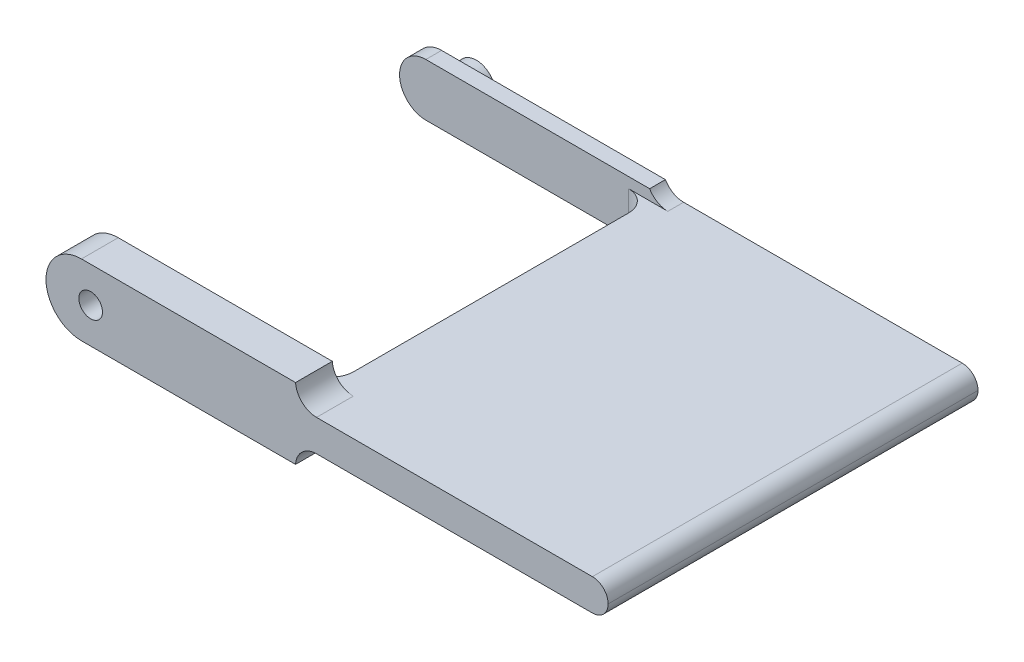
ISO-10303-21;
HEADER;
FILE_DESCRIPTION(('STEP AP214'),'2;1');
FILE_NAME('part.step','',(''),(''),'','','');
FILE_SCHEMA(('AUTOMOTIVE_DESIGN { 1 0 10303 214 1 1 1 1 }'));
ENDSEC;
DATA;
#1=APPLICATION_CONTEXT('core data for automotive mechanical design processes');
#2=APPLICATION_PROTOCOL_DEFINITION('international standard','automotive_design',2000,#1);
#3=PRODUCT_CONTEXT('',#1,'mechanical');
#4=PRODUCT('Part','Part','',(#3));
#5=PRODUCT_RELATED_PRODUCT_CATEGORY('part','',(#4));
#6=PRODUCT_DEFINITION_FORMATION('','',#4);
#7=PRODUCT_DEFINITION_CONTEXT('part definition',#1,'design');
#8=PRODUCT_DEFINITION('design','',#6,#7);
#9=PRODUCT_DEFINITION_SHAPE('','',#8);
#10=(LENGTH_UNIT() NAMED_UNIT(*) SI_UNIT(.MILLI.,.METRE.));
#11=(NAMED_UNIT(*) PLANE_ANGLE_UNIT() SI_UNIT($,.RADIAN.));
#12=(NAMED_UNIT(*) SI_UNIT($,.STERADIAN.) SOLID_ANGLE_UNIT());
#13=UNCERTAINTY_MEASURE_WITH_UNIT(LENGTH_MEASURE(1.E-05),#10,'distance_accuracy_value','');
#14=(GEOMETRIC_REPRESENTATION_CONTEXT(3) GLOBAL_UNCERTAINTY_ASSIGNED_CONTEXT((#13)) GLOBAL_UNIT_ASSIGNED_CONTEXT((#10,
#11,#12)) REPRESENTATION_CONTEXT('',''));
#15=CARTESIAN_POINT('',(0.,0.,0.));
#16=DIRECTION('',(0.,0.,1.));
#17=DIRECTION('',(1.,0.,0.));
#18=AXIS2_PLACEMENT_3D('',#15,#16,#17);
#19=CARTESIAN_POINT('',(0.,0.,0.));
#20=DIRECTION('',(0.,0.,1.));
#21=DIRECTION('',(1.,0.,0.));
#22=AXIS2_PLACEMENT_3D('',#19,#20,#21);
#23=PLANE('',#22);
#24=DIRECTION('',(1.,0.,0.));
#25=VECTOR('',#24,1.);
#26=CARTESIAN_POINT('',(0.,1.5,0.));
#27=LINE('',#26,#25);
#28=CARTESIAN_POINT('',(21.2320508075689,1.5,0.));
#29=VERTEX_POINT('',#28);
#30=CARTESIAN_POINT('',(47.75,1.5,0.));
#31=VERTEX_POINT('',#30);
#32=EDGE_CURVE('E259',#29,#31,#27,.T.);
#33=ORIENTED_EDGE('',*,*,#32,.T.);
#34=CARTESIAN_POINT('',(47.75,0.,0.));
#35=DIRECTION('',(0.,0.,1.));
#36=DIRECTION('',(1.,0.,0.));
#37=AXIS2_PLACEMENT_3D('',#34,#35,#36);
#38=CIRCLE('',#37,1.5);
#39=CARTESIAN_POINT('',(49.25,0.,0.));
#40=VERTEX_POINT('',#39);
#41=EDGE_CURVE('E69',#31,#40,#38,.F.);
#42=ORIENTED_EDGE('',*,*,#41,.T.);
#43=CARTESIAN_POINT('',(47.75,0.,0.));
#44=DIRECTION('',(0.,0.,1.));
#45=DIRECTION('',(1.,0.,0.));
#46=AXIS2_PLACEMENT_3D('',#43,#44,#45);
#47=CIRCLE('',#46,1.5);
#48=CARTESIAN_POINT('',(47.75,-1.5,0.));
#49=VERTEX_POINT('',#48);
#50=EDGE_CURVE('E76',#40,#49,#47,.F.);
#51=ORIENTED_EDGE('',*,*,#50,.T.);
#52=DIRECTION('',(1.,0.,0.));
#53=VECTOR('',#52,1.);
#54=CARTESIAN_POINT('',(0.,-1.5,0.));
#55=LINE('',#54,#53);
#56=CARTESIAN_POINT('',(21.2320508075689,-1.5,0.));
#57=VERTEX_POINT('',#56);
#58=EDGE_CURVE('E261',#57,#49,#55,.T.);
#59=ORIENTED_EDGE('',*,*,#58,.F.);
#60=CARTESIAN_POINT('',(21.2320508075689,-3.5,0.));
#61=DIRECTION('',(0.,0.,1.));
#62=DIRECTION('',(1.,0.,0.));
#63=AXIS2_PLACEMENT_3D('',#60,#61,#62);
#64=CIRCLE('',#63,2.);
#65=CARTESIAN_POINT('',(19.5,-2.5,0.));
#66=VERTEX_POINT('',#65);
#67=EDGE_CURVE('E351',#57,#66,#64,.T.);
#68=ORIENTED_EDGE('',*,*,#67,.T.);
#69=DIRECTION('',(1.,0.,0.));
#70=VECTOR('',#69,1.);
#71=CARTESIAN_POINT('',(0.,-2.5,0.));
#72=LINE('',#71,#70);
#73=CARTESIAN_POINT('',(-1.8,-2.5,0.));
#74=VERTEX_POINT('',#73);
#75=EDGE_CURVE('E237',#74,#66,#72,.T.);
#76=ORIENTED_EDGE('',*,*,#75,.F.);
#77=CARTESIAN_POINT('',(-1.8,0.,0.));
#78=DIRECTION('',(0.,0.,1.));
#79=DIRECTION('',(1.,0.,0.));
#80=AXIS2_PLACEMENT_3D('',#77,#78,#79);
#81=CIRCLE('',#80,2.5);
#82=CARTESIAN_POINT('',(-4.3,0.,0.));
#83=VERTEX_POINT('',#82);
#84=EDGE_CURVE('E406',#74,#83,#81,.F.);
#85=ORIENTED_EDGE('',*,*,#84,.T.);
#86=CARTESIAN_POINT('',(-1.8,0.,0.));
#87=DIRECTION('',(0.,0.,1.));
#88=DIRECTION('',(1.,0.,0.));
#89=AXIS2_PLACEMENT_3D('',#86,#87,#88);
#90=CIRCLE('',#89,2.5);
#91=CARTESIAN_POINT('',(-1.8,2.5,0.));
#92=VERTEX_POINT('',#91);
#93=EDGE_CURVE('E404',#83,#92,#90,.F.);
#94=ORIENTED_EDGE('',*,*,#93,.T.);
#95=DIRECTION('',(1.,0.,0.));
#96=VECTOR('',#95,1.);
#97=CARTESIAN_POINT('',(0.,2.5,0.));
#98=LINE('',#97,#96);
#99=CARTESIAN_POINT('',(19.5,2.5,0.));
#100=VERTEX_POINT('',#99);
#101=EDGE_CURVE('E348',#92,#100,#98,.T.);
#102=ORIENTED_EDGE('',*,*,#101,.T.);
#103=CARTESIAN_POINT('',(21.2320508075689,3.5,0.));
#104=DIRECTION('',(0.,0.,1.));
#105=DIRECTION('',(1.,0.,0.));
#106=AXIS2_PLACEMENT_3D('',#103,#104,#105);
#107=CIRCLE('',#106,2.);
#108=EDGE_CURVE('E247',#100,#29,#107,.T.);
#109=ORIENTED_EDGE('',*,*,#108,.T.);
#110=EDGE_LOOP('',(#33,#42,#51,#59,#68,#76,#85,#94,#102,#109));
#111=FACE_BOUND('',#110,.T.);
#112=CARTESIAN_POINT('',(0.,0.,0.));
#113=DIRECTION('',(0.,0.,1.));
#114=DIRECTION('',(1.,0.,0.));
#115=AXIS2_PLACEMENT_3D('',#112,#113,#114);
#116=CIRCLE('',#115,1.85);
#117=CARTESIAN_POINT('',(1.85,0.,0.));
#118=VERTEX_POINT('',#117);
#119=EDGE_CURVE('E333',#118,#118,#116,.F.);
#120=ORIENTED_EDGE('',*,*,#119,.F.);
#121=EDGE_LOOP('',(#120));
#122=FACE_BOUND('',#121,.T.);
#123=ADVANCED_FACE('F60',(#111,#122),#23,.F.);
#124=CARTESIAN_POINT('',(19.5,0.,-29.9008779135329));
#125=DIRECTION('',(-1.,0.,0.));
#126=DIRECTION('',(0.,0.,1.));
#127=AXIS2_PLACEMENT_3D('',#124,#125,#126);
#128=PLANE('',#127);
#129=DIRECTION('',(0.,0.,1.));
#130=VECTOR('',#129,1.);
#131=CARTESIAN_POINT('',(19.5,-1.5,-29.9008779135329));
#132=LINE('',#131,#130);
#133=CARTESIAN_POINT('',(19.5,-1.5,3.5));
#134=VERTEX_POINT('',#133);
#135=CARTESIAN_POINT('',(19.5,-1.5,29.7));
#136=VERTEX_POINT('',#135);
#137=EDGE_CURVE('E262',#134,#136,#132,.T.);
#138=ORIENTED_EDGE('',*,*,#137,.T.);
#139=DIRECTION('',(0.,1.,0.));
#140=VECTOR('',#139,1.);
#141=CARTESIAN_POINT('',(19.5,0.,29.7));
#142=LINE('',#141,#140);
#143=CARTESIAN_POINT('',(19.5,1.5,29.7));
#144=VERTEX_POINT('',#143);
#145=EDGE_CURVE('E366',#136,#144,#142,.T.);
#146=ORIENTED_EDGE('',*,*,#145,.T.);
#147=DIRECTION('',(0.,0.,1.));
#148=VECTOR('',#147,1.);
#149=CARTESIAN_POINT('',(19.5,1.5,-29.9008779135329));
#150=LINE('',#149,#148);
#151=CARTESIAN_POINT('',(19.5,1.5,3.5));
#152=VERTEX_POINT('',#151);
#153=EDGE_CURVE('E265',#152,#144,#150,.T.);
#154=ORIENTED_EDGE('',*,*,#153,.F.);
#155=DIRECTION('',(0.,-1.,0.));
#156=VECTOR('',#155,1.);
#157=CARTESIAN_POINT('',(19.5,0.,3.5));
#158=LINE('',#157,#156);
#159=EDGE_CURVE('E363',#152,#134,#158,.T.);
#160=ORIENTED_EDGE('',*,*,#159,.T.);
#161=EDGE_LOOP('',(#138,#146,#154,#160));
#162=FACE_BOUND('',#161,.T.);
#163=ADVANCED_FACE('F420',(#162),#128,.T.);
#164=CARTESIAN_POINT('',(0.,0.,33.2));
#165=DIRECTION('',(0.,0.,1.));
#166=DIRECTION('',(1.,0.,0.));
#167=AXIS2_PLACEMENT_3D('',#164,#165,#166);
#168=PLANE('',#167);
#169=CARTESIAN_POINT('',(0.,0.,33.2));
#170=DIRECTION('',(0.,0.,1.));
#171=DIRECTION('',(1.,0.,0.));
#172=AXIS2_PLACEMENT_3D('',#169,#170,#171);
#173=CIRCLE('',#172,1.125);
#174=CARTESIAN_POINT('',(1.125,0.,33.2));
#175=VERTEX_POINT('',#174);
#176=EDGE_CURVE('E300',#175,#175,#173,.T.);
#177=ORIENTED_EDGE('',*,*,#176,.T.);
#178=EDGE_LOOP('',(#177));
#179=FACE_BOUND('',#178,.T.);
#180=DIRECTION('',(-1.,0.,0.));
#181=VECTOR('',#180,1.);
#182=CARTESIAN_POINT('',(0.,1.635,33.2));
#183=LINE('',#182,#181);
#184=CARTESIAN_POINT('',(12.065,1.63500000000001,33.2));
#185=VERTEX_POINT('',#184);
#186=CARTESIAN_POINT('',(2.5153081322176,1.63500000000001,33.2));
#187=VERTEX_POINT('',#186);
#188=EDGE_CURVE('E264',#185,#187,#183,.T.);
#189=ORIENTED_EDGE('',*,*,#188,.F.);
#190=CARTESIAN_POINT('',(12.065,0.,33.2));
#191=DIRECTION('',(0.,0.,1.));
#192=DIRECTION('',(1.,0.,0.));
#193=AXIS2_PLACEMENT_3D('',#190,#191,#192);
#194=CIRCLE('',#193,1.635);
#195=CARTESIAN_POINT('',(12.065,-1.635,33.2));
#196=VERTEX_POINT('',#195);
#197=EDGE_CURVE('E290',#185,#196,#194,.F.);
#198=ORIENTED_EDGE('',*,*,#197,.T.);
#199=DIRECTION('',(-1.,0.,0.));
#200=VECTOR('',#199,1.);
#201=CARTESIAN_POINT('',(0.,-1.635,33.2));
#202=LINE('',#201,#200);
#203=CARTESIAN_POINT('',(2.5153081322176,-1.635,33.2));
#204=VERTEX_POINT('',#203);
#205=EDGE_CURVE('E293',#196,#204,#202,.T.);
#206=ORIENTED_EDGE('',*,*,#205,.T.);
#207=CARTESIAN_POINT('',(0.,0.,33.2));
#208=DIRECTION('',(0.,0.,1.));
#209=DIRECTION('',(1.,0.,0.));
#210=AXIS2_PLACEMENT_3D('',#207,#208,#209);
#211=CIRCLE('',#210,3.);
#212=EDGE_CURVE('E274',#187,#204,#211,.T.);
#213=ORIENTED_EDGE('',*,*,#212,.F.);
#214=EDGE_LOOP('',(#189,#198,#206,#213));
#215=FACE_BOUND('',#214,.T.);
#216=ADVANCED_FACE('F425',(#179,#215),#168,.F.);
#217=CARTESIAN_POINT('',(0.,-3.375,35.2));
#218=DIRECTION('',(0.,1.,0.));
#219=DIRECTION('',(0.,0.,1.));
#220=AXIS2_PLACEMENT_3D('',#217,#218,#219);
#221=PLANE('',#220);
#222=DIRECTION('',(1.,0.,0.));
#223=VECTOR('',#222,1.);
#224=CARTESIAN_POINT('',(0.,-3.375,35.2));
#225=LINE('',#224,#223);
#226=CARTESIAN_POINT('',(-0.875,-3.375,35.2));
#227=VERTEX_POINT('',#226);
#228=CARTESIAN_POINT('',(19.5,-3.375,35.2));
#229=VERTEX_POINT('',#228);
#230=EDGE_CURVE('E310',#227,#229,#225,.T.);
#231=ORIENTED_EDGE('',*,*,#230,.F.);
#232=DIRECTION('',(0.,0.,-1.));
#233=VECTOR('',#232,1.);
#234=CARTESIAN_POINT('',(-0.875,-3.375,31.7));
#235=LINE('',#234,#233);
#236=CARTESIAN_POINT('',(-0.875,-3.375,31.7));
#237=VERTEX_POINT('',#236);
#238=EDGE_CURVE('E395',#227,#237,#235,.T.);
#239=ORIENTED_EDGE('',*,*,#238,.T.);
#240=DIRECTION('',(1.,0.,0.));
#241=VECTOR('',#240,1.);
#242=CARTESIAN_POINT('',(0.,-3.375,31.7));
#243=LINE('',#242,#241);
#244=CARTESIAN_POINT('',(19.5,-3.375,31.7));
#245=VERTEX_POINT('',#244);
#246=EDGE_CURVE('E271',#237,#245,#243,.T.);
#247=ORIENTED_EDGE('',*,*,#246,.T.);
#248=DIRECTION('',(0.,0.,-1.));
#249=VECTOR('',#248,1.);
#250=CARTESIAN_POINT('',(19.5,-3.375,35.2));
#251=LINE('',#250,#249);
#252=EDGE_CURVE('E319',#229,#245,#251,.T.);
#253=ORIENTED_EDGE('',*,*,#252,.F.);
#254=EDGE_LOOP('',(#231,#239,#247,#253));
#255=FACE_BOUND('',#254,.T.);
#256=ADVANCED_FACE('F465',(#255),#221,.F.);
#257=CARTESIAN_POINT('',(0.,3.375,35.2));
#258=DIRECTION('',(0.,1.,0.));
#259=DIRECTION('',(0.,0.,1.));
#260=AXIS2_PLACEMENT_3D('',#257,#258,#259);
#261=PLANE('',#260);
#262=DIRECTION('',(1.,0.,0.));
#263=VECTOR('',#262,1.);
#264=CARTESIAN_POINT('',(0.,3.375,31.7));
#265=LINE('',#264,#263);
#266=CARTESIAN_POINT('',(-0.875,3.375,31.7));
#267=VERTEX_POINT('',#266);
#268=CARTESIAN_POINT('',(19.5,3.375,31.7));
#269=VERTEX_POINT('',#268);
#270=EDGE_CURVE('E273',#267,#269,#265,.T.);
#271=ORIENTED_EDGE('',*,*,#270,.F.);
#272=DIRECTION('',(0.,0.,-1.));
#273=VECTOR('',#272,1.);
#274=CARTESIAN_POINT('',(-0.875,3.375,35.2));
#275=LINE('',#274,#273);
#276=CARTESIAN_POINT('',(-0.875,3.375,35.2));
#277=VERTEX_POINT('',#276);
#278=EDGE_CURVE('E388',#267,#277,#275,.F.);
#279=ORIENTED_EDGE('',*,*,#278,.T.);
#280=DIRECTION('',(1.,0.,0.));
#281=VECTOR('',#280,1.);
#282=CARTESIAN_POINT('',(0.,3.375,35.2));
#283=LINE('',#282,#281);
#284=CARTESIAN_POINT('',(19.5,3.375,35.2));
#285=VERTEX_POINT('',#284);
#286=EDGE_CURVE('E312',#277,#285,#283,.T.);
#287=ORIENTED_EDGE('',*,*,#286,.T.);
#288=DIRECTION('',(0.,0.,-1.));
#289=VECTOR('',#288,1.);
#290=CARTESIAN_POINT('',(19.5,3.375,35.2));
#291=LINE('',#290,#289);
#292=EDGE_CURVE('E314',#285,#269,#291,.T.);
#293=ORIENTED_EDGE('',*,*,#292,.T.);
#294=EDGE_LOOP('',(#271,#279,#287,#293));
#295=FACE_BOUND('',#294,.T.);
#296=ADVANCED_FACE('F467',(#295),#261,.T.);
#297=CARTESIAN_POINT('',(0.,0.,35.2));
#298=DIRECTION('',(0.,0.,-1.));
#299=DIRECTION('',(-1.,0.,0.));
#300=AXIS2_PLACEMENT_3D('',#297,#298,#299);
#301=CYLINDRICAL_SURFACE('',#300,1.125);
#302=CARTESIAN_POINT('',(0.,0.,35.2));
#303=DIRECTION('',(0.,0.,1.));
#304=DIRECTION('',(1.,0.,0.));
#305=AXIS2_PLACEMENT_3D('',#302,#303,#304);
#306=CIRCLE('',#305,1.125);
#307=CARTESIAN_POINT('',(1.125,0.,35.2));
#308=VERTEX_POINT('',#307);
#309=EDGE_CURVE('E307',#308,#308,#306,.T.);
#310=ORIENTED_EDGE('',*,*,#309,.T.);
#311=EDGE_LOOP('',(#310));
#312=FACE_BOUND('',#311,.T.);
#313=ORIENTED_EDGE('',*,*,#176,.F.);
#314=EDGE_LOOP('',(#313));
#315=FACE_BOUND('',#314,.T.);
#316=ADVANCED_FACE('F461',(#312,#315),#301,.F.);
#317=CARTESIAN_POINT('',(0.,0.,35.2));
#318=DIRECTION('',(0.,0.,1.));
#319=DIRECTION('',(1.,0.,0.));
#320=AXIS2_PLACEMENT_3D('',#317,#318,#319);
#321=PLANE('',#320);
#322=ORIENTED_EDGE('',*,*,#309,.F.);
#323=EDGE_LOOP('',(#322));
#324=FACE_BOUND('',#323,.T.);
#325=CARTESIAN_POINT('',(47.75,0.,35.2));
#326=DIRECTION('',(0.,0.,1.));
#327=DIRECTION('',(1.,0.,0.));
#328=AXIS2_PLACEMENT_3D('',#325,#326,#327);
#329=CIRCLE('',#328,1.5);
#330=CARTESIAN_POINT('',(47.75,-1.5,35.2));
#331=VERTEX_POINT('',#330);
#332=CARTESIAN_POINT('',(49.25,0.,35.2));
#333=VERTEX_POINT('',#332);
#334=EDGE_CURVE('E330',#331,#333,#329,.T.);
#335=ORIENTED_EDGE('',*,*,#334,.T.);
#336=CARTESIAN_POINT('',(47.75,0.,35.2));
#337=DIRECTION('',(0.,0.,1.));
#338=DIRECTION('',(1.,0.,0.));
#339=AXIS2_PLACEMENT_3D('',#336,#337,#338);
#340=CIRCLE('',#339,1.5);
#341=CARTESIAN_POINT('',(47.75,1.5,35.2));
#342=VERTEX_POINT('',#341);
#343=EDGE_CURVE('E332',#333,#342,#340,.T.);
#344=ORIENTED_EDGE('',*,*,#343,.T.);
#345=DIRECTION('',(-1.,0.,0.));
#346=VECTOR('',#345,1.);
#347=CARTESIAN_POINT('',(0.,1.5,35.2));
#348=LINE('',#347,#346);
#349=CARTESIAN_POINT('',(21.4960899278339,1.5,35.2));
#350=VERTEX_POINT('',#349);
#351=EDGE_CURVE('E268',#342,#350,#348,.T.);
#352=ORIENTED_EDGE('',*,*,#351,.T.);
#353=CARTESIAN_POINT('',(21.4960899278339,3.5,35.2));
#354=DIRECTION('',(0.,0.,1.));
#355=DIRECTION('',(1.,0.,0.));
#356=AXIS2_PLACEMENT_3D('',#353,#354,#355);
#357=CIRCLE('',#356,2.);
#358=EDGE_CURVE('E542',#350,#285,#357,.F.);
#359=ORIENTED_EDGE('',*,*,#358,.T.);
#360=ORIENTED_EDGE('',*,*,#286,.F.);
#361=CARTESIAN_POINT('',(-0.875,0.,35.2));
#362=DIRECTION('',(0.,0.,1.));
#363=DIRECTION('',(1.,0.,0.));
#364=AXIS2_PLACEMENT_3D('',#361,#362,#363);
#365=CIRCLE('',#364,3.375);
#366=CARTESIAN_POINT('',(-4.25,0.,35.2));
#367=VERTEX_POINT('',#366);
#368=EDGE_CURVE('E393',#277,#367,#365,.T.);
#369=ORIENTED_EDGE('',*,*,#368,.T.);
#370=CARTESIAN_POINT('',(-0.875,0.,35.2));
#371=DIRECTION('',(0.,0.,1.));
#372=DIRECTION('',(1.,0.,0.));
#373=AXIS2_PLACEMENT_3D('',#370,#371,#372);
#374=CIRCLE('',#373,3.375);
#375=EDGE_CURVE('E391',#367,#227,#374,.T.);
#376=ORIENTED_EDGE('',*,*,#375,.T.);
#377=ORIENTED_EDGE('',*,*,#230,.T.);
#378=CARTESIAN_POINT('',(21.4960899278339,-3.5,35.2));
#379=DIRECTION('',(0.,0.,1.));
#380=DIRECTION('',(1.,0.,0.));
#381=AXIS2_PLACEMENT_3D('',#378,#379,#380);
#382=CIRCLE('',#381,2.);
#383=CARTESIAN_POINT('',(21.4960899278339,-1.5,35.2));
#384=VERTEX_POINT('',#383);
#385=EDGE_CURVE('E357',#229,#384,#382,.F.);
#386=ORIENTED_EDGE('',*,*,#385,.T.);
#387=DIRECTION('',(-1.,0.,0.));
#388=VECTOR('',#387,1.);
#389=CARTESIAN_POINT('',(0.,-1.5,35.2));
#390=LINE('',#389,#388);
#391=EDGE_CURVE('E254',#331,#384,#390,.T.);
#392=ORIENTED_EDGE('',*,*,#391,.F.);
#393=EDGE_LOOP('',(#335,#344,#352,#359,#360,#369,#376,#377,#386,#392));
#394=FACE_BOUND('',#393,.T.);
#395=ADVANCED_FACE('F457',(#324,#394),#321,.T.);
#396=CARTESIAN_POINT('',(0.,1.635,31.7));
#397=DIRECTION('',(0.,1.,0.));
#398=DIRECTION('',(-1.,0.,0.));
#399=AXIS2_PLACEMENT_3D('',#396,#397,#398);
#400=PLANE('',#399);
#401=ORIENTED_EDGE('',*,*,#188,.T.);
#402=DIRECTION('',(0.,0.,1.));
#403=VECTOR('',#402,1.);
#404=CARTESIAN_POINT('',(2.5153081322176,1.63500000000001,31.7));
#405=LINE('',#404,#403);
#406=CARTESIAN_POINT('',(2.5153081322176,1.63500000000001,31.7));
#407=VERTEX_POINT('',#406);
#408=EDGE_CURVE('E298',#407,#187,#405,.T.);
#409=ORIENTED_EDGE('',*,*,#408,.F.);
#410=DIRECTION('',(-1.,0.,0.));
#411=VECTOR('',#410,1.);
#412=CARTESIAN_POINT('',(0.,1.635,31.7));
#413=LINE('',#412,#411);
#414=CARTESIAN_POINT('',(12.065,1.63500000000001,31.7));
#415=VERTEX_POINT('',#414);
#416=EDGE_CURVE('E276',#415,#407,#413,.T.);
#417=ORIENTED_EDGE('',*,*,#416,.F.);
#418=DIRECTION('',(0.,0.,1.));
#419=VECTOR('',#418,1.);
#420=CARTESIAN_POINT('',(12.065,1.63500000000001,31.7));
#421=LINE('',#420,#419);
#422=EDGE_CURVE('E287',#415,#185,#421,.T.);
#423=ORIENTED_EDGE('',*,*,#422,.T.);
#424=EDGE_LOOP('',(#401,#409,#417,#423));
#425=FACE_BOUND('',#424,.T.);
#426=ADVANCED_FACE('F447',(#425),#400,.F.);
#427=CARTESIAN_POINT('',(0.,0.,31.7));
#428=DIRECTION('',(0.,0.,1.));
#429=DIRECTION('',(1.,0.,0.));
#430=AXIS2_PLACEMENT_3D('',#427,#428,#429);
#431=CYLINDRICAL_SURFACE('',#430,3.);
#432=ORIENTED_EDGE('',*,*,#212,.T.);
#433=DIRECTION('',(0.,0.,1.));
#434=VECTOR('',#433,1.);
#435=CARTESIAN_POINT('',(2.5153081322176,-1.635,31.7));
#436=LINE('',#435,#434);
#437=CARTESIAN_POINT('',(2.5153081322176,-1.635,31.7));
#438=VERTEX_POINT('',#437);
#439=EDGE_CURVE('E301',#438,#204,#436,.T.);
#440=ORIENTED_EDGE('',*,*,#439,.F.);
#441=CARTESIAN_POINT('',(0.,0.,31.7));
#442=DIRECTION('',(0.,0.,1.));
#443=DIRECTION('',(1.,0.,0.));
#444=AXIS2_PLACEMENT_3D('',#441,#442,#443);
#445=CIRCLE('',#444,3.);
#446=EDGE_CURVE('E285',#407,#438,#445,.T.);
#447=ORIENTED_EDGE('',*,*,#446,.F.);
#448=ORIENTED_EDGE('',*,*,#408,.T.);
#449=EDGE_LOOP('',(#432,#440,#447,#448));
#450=FACE_BOUND('',#449,.T.);
#451=ADVANCED_FACE('F443',(#450),#431,.F.);
#452=CARTESIAN_POINT('',(0.,-1.635,31.7));
#453=DIRECTION('',(0.,1.,0.));
#454=DIRECTION('',(-1.,0.,0.));
#455=AXIS2_PLACEMENT_3D('',#452,#453,#454);
#456=PLANE('',#455);
#457=ORIENTED_EDGE('',*,*,#205,.F.);
#458=DIRECTION('',(0.,0.,1.));
#459=VECTOR('',#458,1.);
#460=CARTESIAN_POINT('',(12.065,-1.635,31.7));
#461=LINE('',#460,#459);
#462=CARTESIAN_POINT('',(12.065,-1.635,31.7));
#463=VERTEX_POINT('',#462);
#464=EDGE_CURVE('E303',#463,#196,#461,.T.);
#465=ORIENTED_EDGE('',*,*,#464,.F.);
#466=DIRECTION('',(-1.,0.,0.));
#467=VECTOR('',#466,1.);
#468=CARTESIAN_POINT('',(0.,-1.635,31.7));
#469=LINE('',#468,#467);
#470=EDGE_CURVE('E282',#463,#438,#469,.T.);
#471=ORIENTED_EDGE('',*,*,#470,.T.);
#472=ORIENTED_EDGE('',*,*,#439,.T.);
#473=EDGE_LOOP('',(#457,#465,#471,#472));
#474=FACE_BOUND('',#473,.T.);
#475=ADVANCED_FACE('F446',(#474),#456,.T.);
#476=CARTESIAN_POINT('',(12.065,0.,31.7));
#477=DIRECTION('',(0.,0.,1.));
#478=DIRECTION('',(1.,0.,0.));
#479=AXIS2_PLACEMENT_3D('',#476,#477,#478);
#480=CYLINDRICAL_SURFACE('',#479,1.635);
#481=ORIENTED_EDGE('',*,*,#197,.F.);
#482=ORIENTED_EDGE('',*,*,#422,.F.);
#483=CARTESIAN_POINT('',(12.065,0.,31.7));
#484=DIRECTION('',(0.,0.,1.));
#485=DIRECTION('',(1.,0.,0.));
#486=AXIS2_PLACEMENT_3D('',#483,#484,#485);
#487=CIRCLE('',#486,1.635);
#488=EDGE_CURVE('E279',#415,#463,#487,.F.);
#489=ORIENTED_EDGE('',*,*,#488,.T.);
#490=ORIENTED_EDGE('',*,*,#464,.T.);
#491=EDGE_LOOP('',(#481,#482,#489,#490));
#492=FACE_BOUND('',#491,.T.);
#493=ADVANCED_FACE('F441',(#492),#480,.F.);
#494=CARTESIAN_POINT('',(0.,0.,31.7));
#495=DIRECTION('',(0.,0.,1.));
#496=DIRECTION('',(1.,0.,0.));
#497=AXIS2_PLACEMENT_3D('',#494,#495,#496);
#498=PLANE('',#497);
#499=CARTESIAN_POINT('',(-0.875,0.,31.7));
#500=DIRECTION('',(0.,0.,1.));
#501=DIRECTION('',(1.,0.,0.));
#502=AXIS2_PLACEMENT_3D('',#499,#500,#501);
#503=CIRCLE('',#502,3.375);
#504=CARTESIAN_POINT('',(-4.25,0.,31.7));
#505=VERTEX_POINT('',#504);
#506=EDGE_CURVE('E384',#237,#505,#503,.F.);
#507=ORIENTED_EDGE('',*,*,#506,.T.);
#508=CARTESIAN_POINT('',(-0.875,0.,31.7));
#509=DIRECTION('',(0.,0.,1.));
#510=DIRECTION('',(1.,0.,0.));
#511=AXIS2_PLACEMENT_3D('',#508,#509,#510);
#512=CIRCLE('',#511,3.375);
#513=EDGE_CURVE('E386',#505,#267,#512,.F.);
#514=ORIENTED_EDGE('',*,*,#513,.T.);
#515=ORIENTED_EDGE('',*,*,#270,.T.);
#516=CARTESIAN_POINT('',(21.4960899278339,3.5,31.7));
#517=DIRECTION('',(0.,0.,1.));
#518=DIRECTION('',(1.,0.,0.));
#519=AXIS2_PLACEMENT_3D('',#516,#517,#518);
#520=CIRCLE('',#519,2.);
#521=CARTESIAN_POINT('',(21.4960899278339,1.5,31.7));
#522=VERTEX_POINT('',#521);
#523=EDGE_CURVE('E248',#269,#522,#520,.T.);
#524=ORIENTED_EDGE('',*,*,#523,.T.);
#525=DIRECTION('',(1.,0.,0.));
#526=VECTOR('',#525,1.);
#527=CARTESIAN_POINT('',(0.,1.5,31.7));
#528=LINE('',#527,#526);
#529=CARTESIAN_POINT('',(17.5,1.5,31.7));
#530=VERTEX_POINT('',#529);
#531=EDGE_CURVE('E552',#530,#522,#528,.T.);
#532=ORIENTED_EDGE('',*,*,#531,.F.);
#533=DIRECTION('',(0.,1.,0.));
#534=VECTOR('',#533,1.);
#535=CARTESIAN_POINT('',(17.5,0.,31.7));
#536=LINE('',#535,#534);
#537=CARTESIAN_POINT('',(17.5,-1.5,31.7));
#538=VERTEX_POINT('',#537);
#539=EDGE_CURVE('E369',#530,#538,#536,.F.);
#540=ORIENTED_EDGE('',*,*,#539,.T.);
#541=DIRECTION('',(-1.,0.,0.));
#542=VECTOR('',#541,1.);
#543=CARTESIAN_POINT('',(0.,-1.5,31.7));
#544=LINE('',#543,#542);
#545=CARTESIAN_POINT('',(21.4960899278339,-1.5,31.7));
#546=VERTEX_POINT('',#545);
#547=EDGE_CURVE('E561',#546,#538,#544,.T.);
#548=ORIENTED_EDGE('',*,*,#547,.F.);
#549=CARTESIAN_POINT('',(21.4960899278339,-3.5,31.7));
#550=DIRECTION('',(0.,0.,1.));
#551=DIRECTION('',(1.,0.,0.));
#552=AXIS2_PLACEMENT_3D('',#549,#550,#551);
#553=CIRCLE('',#552,2.);
#554=EDGE_CURVE('E360',#546,#245,#553,.T.);
#555=ORIENTED_EDGE('',*,*,#554,.T.);
#556=ORIENTED_EDGE('',*,*,#246,.F.);
#557=EDGE_LOOP('',(#507,#514,#515,#524,#532,#540,#548,#555,#556));
#558=FACE_BOUND('',#557,.T.);
#559=ORIENTED_EDGE('',*,*,#416,.T.);
#560=ORIENTED_EDGE('',*,*,#446,.T.);
#561=ORIENTED_EDGE('',*,*,#470,.F.);
#562=ORIENTED_EDGE('',*,*,#488,.F.);
#563=EDGE_LOOP('',(#559,#560,#561,#562));
#564=FACE_BOUND('',#563,.T.);
#565=ADVANCED_FACE('F437',(#558,#564),#498,.F.);
#566=CARTESIAN_POINT('',(0.,-1.5,-29.9008779135329));
#567=DIRECTION('',(0.,1.,0.));
#568=DIRECTION('',(0.,0.,1.));
#569=AXIS2_PLACEMENT_3D('',#566,#567,#568);
#570=PLANE('',#569);
#571=ORIENTED_EDGE('',*,*,#58,.T.);
#572=DIRECTION('',(0.,0.,1.));
#573=VECTOR('',#572,1.);
#574=CARTESIAN_POINT('',(47.75,-1.5,35.2));
#575=LINE('',#574,#573);
#576=EDGE_CURVE('E12',#49,#331,#575,.T.);
#577=ORIENTED_EDGE('',*,*,#576,.T.);
#578=ORIENTED_EDGE('',*,*,#391,.T.);
#579=DIRECTION('',(0.,0.,-1.));
#580=VECTOR('',#579,1.);
#581=CARTESIAN_POINT('',(21.4960899278339,-1.5,-29.9008779135329));
#582=LINE('',#581,#580);
#583=EDGE_CURVE('E546',#384,#546,#582,.T.);
#584=ORIENTED_EDGE('',*,*,#583,.T.);
#585=ORIENTED_EDGE('',*,*,#547,.T.);
#586=CARTESIAN_POINT('',(17.5,-1.5,29.7));
#587=DIRECTION('',(0.,1.,0.));
#588=DIRECTION('',(0.,0.,1.));
#589=AXIS2_PLACEMENT_3D('',#586,#587,#588);
#590=CIRCLE('',#589,2.);
#591=EDGE_CURVE('E377',#538,#136,#590,.T.);
#592=ORIENTED_EDGE('',*,*,#591,.T.);
#593=ORIENTED_EDGE('',*,*,#137,.F.);
#594=CARTESIAN_POINT('',(17.5,-1.5,3.5));
#595=DIRECTION('',(0.,1.,0.));
#596=DIRECTION('',(0.,0.,1.));
#597=AXIS2_PLACEMENT_3D('',#594,#595,#596);
#598=CIRCLE('',#597,2.);
#599=CARTESIAN_POINT('',(17.5,-1.5,1.5));
#600=VERTEX_POINT('',#599);
#601=EDGE_CURVE('E379',#134,#600,#598,.T.);
#602=ORIENTED_EDGE('',*,*,#601,.T.);
#603=DIRECTION('',(1.,0.,0.));
#604=VECTOR('',#603,1.);
#605=CARTESIAN_POINT('',(0.,-1.5,1.5));
#606=LINE('',#605,#604);
#607=CARTESIAN_POINT('',(21.2320508075689,-1.5,1.5));
#608=VERTEX_POINT('',#607);
#609=EDGE_CURVE('E539',#600,#608,#606,.T.);
#610=ORIENTED_EDGE('',*,*,#609,.T.);
#611=DIRECTION('',(0.,0.,1.));
#612=VECTOR('',#611,1.);
#613=CARTESIAN_POINT('',(21.2320508075689,-1.5,-29.9008779135329));
#614=LINE('',#613,#612);
#615=EDGE_CURVE('E537',#608,#57,#614,.F.);
#616=ORIENTED_EDGE('',*,*,#615,.T.);
#617=EDGE_LOOP('',(#571,#577,#578,#584,#585,#592,#593,#602,#610,#616));
#618=FACE_BOUND('',#617,.T.);
#619=ADVANCED_FACE('F433',(#618),#570,.F.);
#620=CARTESIAN_POINT('',(0.,1.5,-29.9008779135329));
#621=DIRECTION('',(0.,1.,0.));
#622=DIRECTION('',(-1.,0.,0.));
#623=AXIS2_PLACEMENT_3D('',#620,#621,#622);
#624=PLANE('',#623);
#625=ORIENTED_EDGE('',*,*,#351,.F.);
#626=DIRECTION('',(0.,0.,1.));
#627=VECTOR('',#626,1.);
#628=CARTESIAN_POINT('',(47.75,1.5,-29.9008779135329));
#629=LINE('',#628,#627);
#630=EDGE_CURVE('E335',#342,#31,#629,.F.);
#631=ORIENTED_EDGE('',*,*,#630,.T.);
#632=ORIENTED_EDGE('',*,*,#32,.F.);
#633=DIRECTION('',(0.,0.,-1.));
#634=VECTOR('',#633,1.);
#635=CARTESIAN_POINT('',(21.2320508075689,1.5,1.5));
#636=LINE('',#635,#634);
#637=CARTESIAN_POINT('',(21.2320508075689,1.5,1.5));
#638=VERTEX_POINT('',#637);
#639=EDGE_CURVE('E558',#29,#638,#636,.F.);
#640=ORIENTED_EDGE('',*,*,#639,.T.);
#641=DIRECTION('',(-1.,0.,0.));
#642=VECTOR('',#641,1.);
#643=CARTESIAN_POINT('',(0.,1.5,1.5));
#644=LINE('',#643,#642);
#645=CARTESIAN_POINT('',(17.5,1.5,1.5));
#646=VERTEX_POINT('',#645);
#647=EDGE_CURVE('E243',#638,#646,#644,.T.);
#648=ORIENTED_EDGE('',*,*,#647,.T.);
#649=CARTESIAN_POINT('',(17.5,1.5,3.5));
#650=DIRECTION('',(0.,1.,0.));
#651=DIRECTION('',(-1.,0.,0.));
#652=AXIS2_PLACEMENT_3D('',#649,#650,#651);
#653=CIRCLE('',#652,2.);
#654=EDGE_CURVE('E382',#646,#152,#653,.F.);
#655=ORIENTED_EDGE('',*,*,#654,.T.);
#656=ORIENTED_EDGE('',*,*,#153,.T.);
#657=CARTESIAN_POINT('',(17.5,1.5,29.7));
#658=DIRECTION('',(0.,1.,0.));
#659=DIRECTION('',(-1.,0.,0.));
#660=AXIS2_PLACEMENT_3D('',#657,#658,#659);
#661=CIRCLE('',#660,2.);
#662=EDGE_CURVE('E374',#144,#530,#661,.F.);
#663=ORIENTED_EDGE('',*,*,#662,.T.);
#664=ORIENTED_EDGE('',*,*,#531,.T.);
#665=DIRECTION('',(0.,0.,1.));
#666=VECTOR('',#665,1.);
#667=CARTESIAN_POINT('',(21.4960899278339,1.5,35.2));
#668=LINE('',#667,#666);
#669=EDGE_CURVE('E556',#522,#350,#668,.T.);
#670=ORIENTED_EDGE('',*,*,#669,.T.);
#671=EDGE_LOOP('',(#625,#631,#632,#640,#648,#655,#656,#663,#664,#670));
#672=FACE_BOUND('',#671,.T.);
#673=ADVANCED_FACE('F343',(#672),#624,.T.);
#674=CARTESIAN_POINT('',(0.,-2.5,1.5));
#675=DIRECTION('',(0.,1.,0.));
#676=DIRECTION('',(-1.,0.,0.));
#677=AXIS2_PLACEMENT_3D('',#674,#675,#676);
#678=PLANE('',#677);
#679=DIRECTION('',(1.,0.,0.));
#680=VECTOR('',#679,1.);
#681=CARTESIAN_POINT('',(0.,-2.5,1.5));
#682=LINE('',#681,#680);
#683=CARTESIAN_POINT('',(-1.8,-2.5,1.5));
#684=VERTEX_POINT('',#683);
#685=CARTESIAN_POINT('',(19.5,-2.5,1.5));
#686=VERTEX_POINT('',#685);
#687=EDGE_CURVE('E236',#684,#686,#682,.T.);
#688=ORIENTED_EDGE('',*,*,#687,.F.);
#689=DIRECTION('',(0.,0.,-1.));
#690=VECTOR('',#689,1.);
#691=CARTESIAN_POINT('',(-1.8,-2.5,1.5));
#692=LINE('',#691,#690);
#693=EDGE_CURVE('E397',#684,#74,#692,.T.);
#694=ORIENTED_EDGE('',*,*,#693,.T.);
#695=ORIENTED_EDGE('',*,*,#75,.T.);
#696=DIRECTION('',(0.,0.,-1.));
#697=VECTOR('',#696,1.);
#698=CARTESIAN_POINT('',(19.5,-2.5,1.5));
#699=LINE('',#698,#697);
#700=EDGE_CURVE('E251',#686,#66,#699,.T.);
#701=ORIENTED_EDGE('',*,*,#700,.F.);
#702=EDGE_LOOP('',(#688,#694,#695,#701));
#703=FACE_BOUND('',#702,.T.);
#704=ADVANCED_FACE('F432',(#703),#678,.F.);
#705=CARTESIAN_POINT('',(0.,2.5,1.5));
#706=DIRECTION('',(0.,1.,0.));
#707=DIRECTION('',(-1.,0.,0.));
#708=AXIS2_PLACEMENT_3D('',#705,#706,#707);
#709=PLANE('',#708);
#710=ORIENTED_EDGE('',*,*,#101,.F.);
#711=DIRECTION('',(0.,0.,-1.));
#712=VECTOR('',#711,1.);
#713=CARTESIAN_POINT('',(-1.8,2.5,1.5));
#714=LINE('',#713,#712);
#715=CARTESIAN_POINT('',(-1.8,2.5,1.5));
#716=VERTEX_POINT('',#715);
#717=EDGE_CURVE('E233',#92,#716,#714,.F.);
#718=ORIENTED_EDGE('',*,*,#717,.T.);
#719=DIRECTION('',(1.,0.,0.));
#720=VECTOR('',#719,1.);
#721=CARTESIAN_POINT('',(0.,2.5,1.5));
#722=LINE('',#721,#720);
#723=CARTESIAN_POINT('',(19.5,2.5,1.5));
#724=VERTEX_POINT('',#723);
#725=EDGE_CURVE('E225',#716,#724,#722,.T.);
#726=ORIENTED_EDGE('',*,*,#725,.T.);
#727=DIRECTION('',(0.,0.,-1.));
#728=VECTOR('',#727,1.);
#729=CARTESIAN_POINT('',(19.5,2.5,1.5));
#730=LINE('',#729,#728);
#731=EDGE_CURVE('E230',#724,#100,#730,.T.);
#732=ORIENTED_EDGE('',*,*,#731,.T.);
#733=EDGE_LOOP('',(#710,#718,#726,#732));
#734=FACE_BOUND('',#733,.T.);
#735=ADVANCED_FACE('F228',(#734),#709,.T.);
#736=CARTESIAN_POINT('',(0.,0.,1.5));
#737=DIRECTION('',(0.,0.,-1.));
#738=DIRECTION('',(-1.,0.,0.));
#739=AXIS2_PLACEMENT_3D('',#736,#737,#738);
#740=PLANE('',#739);
#741=CARTESIAN_POINT('',(-1.8,0.,1.5));
#742=DIRECTION('',(0.,0.,-1.));
#743=DIRECTION('',(-1.,0.,0.));
#744=AXIS2_PLACEMENT_3D('',#741,#742,#743);
#745=CIRCLE('',#744,2.5);
#746=CARTESIAN_POINT('',(-4.3,0.,1.5));
#747=VERTEX_POINT('',#746);
#748=EDGE_CURVE('E408',#716,#747,#745,.F.);
#749=ORIENTED_EDGE('',*,*,#748,.T.);
#750=CARTESIAN_POINT('',(-1.8,0.,1.5));
#751=DIRECTION('',(0.,0.,-1.));
#752=DIRECTION('',(-1.,0.,0.));
#753=AXIS2_PLACEMENT_3D('',#750,#751,#752);
#754=CIRCLE('',#753,2.5);
#755=EDGE_CURVE('E410',#747,#684,#754,.F.);
#756=ORIENTED_EDGE('',*,*,#755,.T.);
#757=ORIENTED_EDGE('',*,*,#687,.T.);
#758=CARTESIAN_POINT('',(21.2320508075689,-3.5,1.5));
#759=DIRECTION('',(0.,0.,-1.));
#760=DIRECTION('',(-1.,0.,0.));
#761=AXIS2_PLACEMENT_3D('',#758,#759,#760);
#762=CIRCLE('',#761,2.);
#763=EDGE_CURVE('E349',#686,#608,#762,.T.);
#764=ORIENTED_EDGE('',*,*,#763,.T.);
#765=ORIENTED_EDGE('',*,*,#609,.F.);
#766=DIRECTION('',(0.,-1.,0.));
#767=VECTOR('',#766,1.);
#768=CARTESIAN_POINT('',(17.5,0.,1.5));
#769=LINE('',#768,#767);
#770=EDGE_CURVE('E372',#600,#646,#769,.F.);
#771=ORIENTED_EDGE('',*,*,#770,.T.);
#772=ORIENTED_EDGE('',*,*,#647,.F.);
#773=CARTESIAN_POINT('',(21.2320508075689,3.5,1.5));
#774=DIRECTION('',(0.,0.,-1.));
#775=DIRECTION('',(-1.,0.,0.));
#776=AXIS2_PLACEMENT_3D('',#773,#774,#775);
#777=CIRCLE('',#776,2.);
#778=EDGE_CURVE('E240',#638,#724,#777,.T.);
#779=ORIENTED_EDGE('',*,*,#778,.T.);
#780=ORIENTED_EDGE('',*,*,#725,.F.);
#781=EDGE_LOOP('',(#749,#756,#757,#764,#765,#771,#772,#779,#780));
#782=FACE_BOUND('',#781,.T.);
#783=ADVANCED_FACE('F241',(#782),#740,.F.);
#784=CARTESIAN_POINT('',(21.4960899278339,3.5,35.2));
#785=DIRECTION('',(0.,0.,-1.));
#786=DIRECTION('',(-1.,0.,0.));
#787=AXIS2_PLACEMENT_3D('',#784,#785,#786);
#788=CYLINDRICAL_SURFACE('',#787,2.);
#789=ORIENTED_EDGE('',*,*,#523,.F.);
#790=ORIENTED_EDGE('',*,*,#292,.F.);
#791=ORIENTED_EDGE('',*,*,#358,.F.);
#792=ORIENTED_EDGE('',*,*,#669,.F.);
#793=EDGE_LOOP('',(#789,#790,#791,#792));
#794=FACE_BOUND('',#793,.T.);
#795=ADVANCED_FACE('F477',(#794),#788,.F.);
#796=CARTESIAN_POINT('',(21.2320508075689,3.5,1.5));
#797=DIRECTION('',(0.,0.,1.));
#798=DIRECTION('',(1.,0.,0.));
#799=AXIS2_PLACEMENT_3D('',#796,#797,#798);
#800=CYLINDRICAL_SURFACE('',#799,2.);
#801=ORIENTED_EDGE('',*,*,#108,.F.);
#802=ORIENTED_EDGE('',*,*,#731,.F.);
#803=ORIENTED_EDGE('',*,*,#778,.F.);
#804=ORIENTED_EDGE('',*,*,#639,.F.);
#805=EDGE_LOOP('',(#801,#802,#803,#804));
#806=FACE_BOUND('',#805,.T.);
#807=ADVANCED_FACE('F250',(#806),#800,.F.);
#808=CARTESIAN_POINT('',(21.2320508075689,-3.5,1.5));
#809=DIRECTION('',(0.,0.,1.));
#810=DIRECTION('',(1.,0.,0.));
#811=AXIS2_PLACEMENT_3D('',#808,#809,#810);
#812=CYLINDRICAL_SURFACE('',#811,2.);
#813=ORIENTED_EDGE('',*,*,#67,.F.);
#814=ORIENTED_EDGE('',*,*,#615,.F.);
#815=ORIENTED_EDGE('',*,*,#763,.F.);
#816=ORIENTED_EDGE('',*,*,#700,.T.);
#817=EDGE_LOOP('',(#813,#814,#815,#816));
#818=FACE_BOUND('',#817,.T.);
#819=ADVANCED_FACE('F483',(#818),#812,.F.);
#820=CARTESIAN_POINT('',(21.4960899278339,-3.5,35.2));
#821=DIRECTION('',(0.,0.,-1.));
#822=DIRECTION('',(-1.,0.,0.));
#823=AXIS2_PLACEMENT_3D('',#820,#821,#822);
#824=CYLINDRICAL_SURFACE('',#823,2.);
#825=ORIENTED_EDGE('',*,*,#554,.F.);
#826=ORIENTED_EDGE('',*,*,#583,.F.);
#827=ORIENTED_EDGE('',*,*,#385,.F.);
#828=ORIENTED_EDGE('',*,*,#252,.T.);
#829=EDGE_LOOP('',(#825,#826,#827,#828));
#830=FACE_BOUND('',#829,.T.);
#831=ADVANCED_FACE('F486',(#830),#824,.F.);
#832=CARTESIAN_POINT('',(17.5,0.,29.7));
#833=DIRECTION('',(0.,1.,0.));
#834=DIRECTION('',(0.,0.,1.));
#835=AXIS2_PLACEMENT_3D('',#832,#833,#834);
#836=CYLINDRICAL_SURFACE('',#835,2.);
#837=ORIENTED_EDGE('',*,*,#591,.F.);
#838=ORIENTED_EDGE('',*,*,#539,.F.);
#839=ORIENTED_EDGE('',*,*,#662,.F.);
#840=ORIENTED_EDGE('',*,*,#145,.F.);
#841=EDGE_LOOP('',(#837,#838,#839,#840));
#842=FACE_BOUND('',#841,.T.);
#843=ADVANCED_FACE('F490',(#842),#836,.F.);
#844=CARTESIAN_POINT('',(17.5,0.,3.5));
#845=DIRECTION('',(0.,-1.,0.));
#846=DIRECTION('',(0.,0.,-1.));
#847=AXIS2_PLACEMENT_3D('',#844,#845,#846);
#848=CYLINDRICAL_SURFACE('',#847,2.);
#849=ORIENTED_EDGE('',*,*,#654,.F.);
#850=ORIENTED_EDGE('',*,*,#770,.F.);
#851=ORIENTED_EDGE('',*,*,#601,.F.);
#852=ORIENTED_EDGE('',*,*,#159,.F.);
#853=EDGE_LOOP('',(#849,#850,#851,#852));
#854=FACE_BOUND('',#853,.T.);
#855=ADVANCED_FACE('F494',(#854),#848,.F.);
#856=CARTESIAN_POINT('',(-0.875,0.,35.2));
#857=DIRECTION('',(0.,0.,1.));
#858=DIRECTION('',(1.,0.,0.));
#859=AXIS2_PLACEMENT_3D('',#856,#857,#858);
#860=CYLINDRICAL_SURFACE('',#859,3.375);
#861=ORIENTED_EDGE('',*,*,#238,.F.);
#862=ORIENTED_EDGE('',*,*,#375,.F.);
#863=DIRECTION('',(0.,0.,-1.));
#864=VECTOR('',#863,1.);
#865=CARTESIAN_POINT('',(-4.25,0.,35.2));
#866=LINE('',#865,#864);
#867=EDGE_CURVE('E398',#505,#367,#866,.F.);
#868=ORIENTED_EDGE('',*,*,#867,.F.);
#869=ORIENTED_EDGE('',*,*,#506,.F.);
#870=EDGE_LOOP('',(#861,#862,#868,#869));
#871=FACE_BOUND('',#870,.T.);
#872=ADVANCED_FACE('F498',(#871),#860,.T.);
#873=CARTESIAN_POINT('',(-0.875,0.,35.2));
#874=DIRECTION('',(0.,0.,-1.));
#875=DIRECTION('',(-1.,0.,0.));
#876=AXIS2_PLACEMENT_3D('',#873,#874,#875);
#877=CYLINDRICAL_SURFACE('',#876,3.375);
#878=ORIENTED_EDGE('',*,*,#368,.F.);
#879=ORIENTED_EDGE('',*,*,#278,.F.);
#880=ORIENTED_EDGE('',*,*,#513,.F.);
#881=ORIENTED_EDGE('',*,*,#867,.T.);
#882=EDGE_LOOP('',(#878,#879,#880,#881));
#883=FACE_BOUND('',#882,.T.);
#884=ADVANCED_FACE('F500',(#883),#877,.T.);
#885=CARTESIAN_POINT('',(-1.8,0.,1.5));
#886=DIRECTION('',(0.,0.,1.));
#887=DIRECTION('',(1.,0.,0.));
#888=AXIS2_PLACEMENT_3D('',#885,#886,#887);
#889=CYLINDRICAL_SURFACE('',#888,2.5);
#890=DIRECTION('',(0.,0.,-1.));
#891=VECTOR('',#890,1.);
#892=CARTESIAN_POINT('',(-4.3,0.,0.));
#893=LINE('',#892,#891);
#894=EDGE_CURVE('E401',#747,#83,#893,.T.);
#895=ORIENTED_EDGE('',*,*,#894,.F.);
#896=ORIENTED_EDGE('',*,*,#748,.F.);
#897=ORIENTED_EDGE('',*,*,#717,.F.);
#898=ORIENTED_EDGE('',*,*,#93,.F.);
#899=EDGE_LOOP('',(#895,#896,#897,#898));
#900=FACE_BOUND('',#899,.T.);
#901=ADVANCED_FACE('F503',(#900),#889,.T.);
#902=CARTESIAN_POINT('',(-1.8,0.,1.5));
#903=DIRECTION('',(0.,0.,-1.));
#904=DIRECTION('',(-1.,0.,0.));
#905=AXIS2_PLACEMENT_3D('',#902,#903,#904);
#906=CYLINDRICAL_SURFACE('',#905,2.5);
#907=ORIENTED_EDGE('',*,*,#755,.F.);
#908=ORIENTED_EDGE('',*,*,#894,.T.);
#909=ORIENTED_EDGE('',*,*,#84,.F.);
#910=ORIENTED_EDGE('',*,*,#693,.F.);
#911=EDGE_LOOP('',(#907,#908,#909,#910));
#912=FACE_BOUND('',#911,.T.);
#913=ADVANCED_FACE('F508',(#912),#906,.T.);
#914=CARTESIAN_POINT('',(0.,0.,-1.5));
#915=DIRECTION('',(0.,0.,1.));
#916=DIRECTION('',(1.,0.,0.));
#917=AXIS2_PLACEMENT_3D('',#914,#915,#916);
#918=CYLINDRICAL_SURFACE('',#917,1.85);
#919=CARTESIAN_POINT('',(0.,0.,-1.5));
#920=DIRECTION('',(0.,0.,-1.));
#921=DIRECTION('',(-1.,0.,0.));
#922=AXIS2_PLACEMENT_3D('',#919,#920,#921);
#923=CIRCLE('',#922,1.85);
#924=CARTESIAN_POINT('',(-1.85,0.,-1.5));
#925=VERTEX_POINT('',#924);
#926=EDGE_CURVE('E414',#925,#925,#923,.T.);
#927=ORIENTED_EDGE('',*,*,#926,.F.);
#928=EDGE_LOOP('',(#927));
#929=FACE_BOUND('',#928,.T.);
#930=ORIENTED_EDGE('',*,*,#119,.T.);
#931=EDGE_LOOP('',(#930));
#932=FACE_BOUND('',#931,.T.);
#933=ADVANCED_FACE('F418',(#929,#932),#918,.T.);
#934=CARTESIAN_POINT('',(0.,0.,-1.5));
#935=DIRECTION('',(0.,0.,-1.));
#936=DIRECTION('',(-1.,0.,0.));
#937=AXIS2_PLACEMENT_3D('',#934,#935,#936);
#938=PLANE('',#937);
#939=ORIENTED_EDGE('',*,*,#926,.T.);
#940=EDGE_LOOP('',(#939));
#941=FACE_BOUND('',#940,.T.);
#942=ADVANCED_FACE('F519',(#941),#938,.T.);
#943=CARTESIAN_POINT('',(47.75,0.,-29.9008779135329));
#944=DIRECTION('',(0.,0.,-1.));
#945=DIRECTION('',(-1.,0.,0.));
#946=AXIS2_PLACEMENT_3D('',#943,#944,#945);
#947=CYLINDRICAL_SURFACE('',#946,1.5);
#948=ORIENTED_EDGE('',*,*,#576,.F.);
#949=ORIENTED_EDGE('',*,*,#50,.F.);
#950=DIRECTION('',(0.,0.,1.));
#951=VECTOR('',#950,1.);
#952=CARTESIAN_POINT('',(49.25,0.,0.));
#953=LINE('',#952,#951);
#954=EDGE_CURVE('E64',#333,#40,#953,.F.);
#955=ORIENTED_EDGE('',*,*,#954,.F.);
#956=ORIENTED_EDGE('',*,*,#334,.F.);
#957=EDGE_LOOP('',(#948,#949,#955,#956));
#958=FACE_BOUND('',#957,.T.);
#959=ADVANCED_FACE('F62',(#958),#947,.T.);
#960=CARTESIAN_POINT('',(47.75,0.,-29.9008779135329));
#961=DIRECTION('',(0.,0.,1.));
#962=DIRECTION('',(1.,0.,0.));
#963=AXIS2_PLACEMENT_3D('',#960,#961,#962);
#964=CYLINDRICAL_SURFACE('',#963,1.5);
#965=ORIENTED_EDGE('',*,*,#41,.F.);
#966=ORIENTED_EDGE('',*,*,#630,.F.);
#967=ORIENTED_EDGE('',*,*,#343,.F.);
#968=ORIENTED_EDGE('',*,*,#954,.T.);
#969=EDGE_LOOP('',(#965,#966,#967,#968));
#970=FACE_BOUND('',#969,.T.);
#971=ADVANCED_FACE('F514',(#970),#964,.T.);
#972=CLOSED_SHELL('',(#123,#163,#216,#256,#296,#316,#395,#426,#451,#475,#493,#565,#619,#673,
#704,#735,#783,#795,#807,#819,#831,#843,#855,#872,#884,#901,#913,#933,#942,#959,#971));
#973=MANIFOLD_SOLID_BREP('B2',#972);
#974=ADVANCED_BREP_SHAPE_REPRESENTATION('',(#18,#973),#14);
#975=SHAPE_DEFINITION_REPRESENTATION(#9,#974);
ENDSEC;
END-ISO-10303-21;
